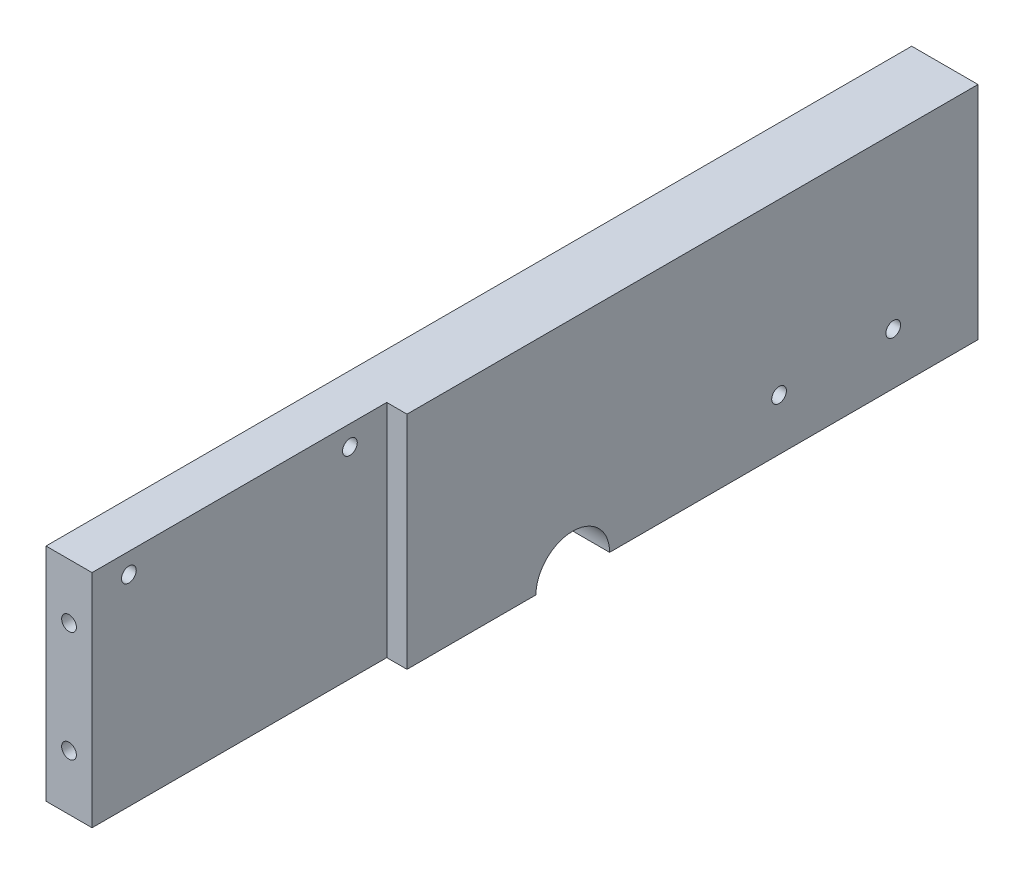
ISO-10303-21;
HEADER;
FILE_DESCRIPTION(('STEP AP214'),'2;1');
FILE_NAME('part.step','',(''),(''),'','','');
FILE_SCHEMA(('AUTOMOTIVE_DESIGN { 1 0 10303 214 1 1 1 1 }'));
ENDSEC;
DATA;
#1=APPLICATION_CONTEXT('core data for automotive mechanical design processes');
#2=APPLICATION_PROTOCOL_DEFINITION('international standard','automotive_design',2000,#1);
#3=PRODUCT_CONTEXT('',#1,'mechanical');
#4=PRODUCT('Part','Part','',(#3));
#5=PRODUCT_RELATED_PRODUCT_CATEGORY('part','',(#4));
#6=PRODUCT_DEFINITION_FORMATION('','',#4);
#7=PRODUCT_DEFINITION_CONTEXT('part definition',#1,'design');
#8=PRODUCT_DEFINITION('design','',#6,#7);
#9=PRODUCT_DEFINITION_SHAPE('','',#8);
#10=(LENGTH_UNIT() NAMED_UNIT(*) SI_UNIT(.MILLI.,.METRE.));
#11=(NAMED_UNIT(*) PLANE_ANGLE_UNIT() SI_UNIT($,.RADIAN.));
#12=(NAMED_UNIT(*) SI_UNIT($,.STERADIAN.) SOLID_ANGLE_UNIT());
#13=UNCERTAINTY_MEASURE_WITH_UNIT(LENGTH_MEASURE(1.E-05),#10,'distance_accuracy_value','');
#14=(GEOMETRIC_REPRESENTATION_CONTEXT(3) GLOBAL_UNCERTAINTY_ASSIGNED_CONTEXT((#13)) GLOBAL_UNIT_ASSIGNED_CONTEXT((#10,
#11,#12)) REPRESENTATION_CONTEXT('',''));
#15=CARTESIAN_POINT('',(0.,0.,0.));
#16=DIRECTION('',(0.,0.,1.));
#17=DIRECTION('',(1.,0.,0.));
#18=AXIS2_PLACEMENT_3D('',#15,#16,#17);
#19=CARTESIAN_POINT('',(12.5,10.604670702918,0.));
#20=DIRECTION('',(0.,1.,0.));
#21=DIRECTION('',(0.,0.,1.));
#22=AXIS2_PLACEMENT_3D('',#19,#20,#21);
#23=PLANE('',#22);
#24=DIRECTION('',(0.,0.,-1.));
#25=VECTOR('',#24,1.);
#26=CARTESIAN_POINT('',(0.,10.604670702918,0.));
#27=LINE('',#26,#25);
#28=CARTESIAN_POINT('',(0.,10.604670702918,64.8267773742609));
#29=VERTEX_POINT('',#28);
#30=CARTESIAN_POINT('',(0.,10.604670702918,-170.173222625739));
#31=VERTEX_POINT('',#30);
#32=EDGE_CURVE('E133',#29,#31,#27,.T.);
#33=ORIENTED_EDGE('',*,*,#32,.F.);
#34=DIRECTION('',(-1.,0.,0.));
#35=VECTOR('',#34,1.);
#36=CARTESIAN_POINT('',(12.5,10.604670702918,64.8267773742609));
#37=LINE('',#36,#35);
#38=CARTESIAN_POINT('',(12.5,10.604670702918,64.8267773742609));
#39=VERTEX_POINT('',#38);
#40=EDGE_CURVE('E11',#39,#29,#37,.T.);
#41=ORIENTED_EDGE('',*,*,#40,.F.);
#42=DIRECTION('',(0.,0.,-1.));
#43=VECTOR('',#42,1.);
#44=CARTESIAN_POINT('',(12.5,10.604670702918,0.));
#45=LINE('',#44,#43);
#46=CARTESIAN_POINT('',(12.5,10.604670702918,-15.1732226257391));
#47=VERTEX_POINT('',#46);
#48=EDGE_CURVE('E81',#39,#47,#45,.T.);
#49=ORIENTED_EDGE('',*,*,#48,.T.);
#50=DIRECTION('',(-1.,0.,0.));
#51=VECTOR('',#50,1.);
#52=CARTESIAN_POINT('',(18.,10.604670702918,-15.1732226257391));
#53=LINE('',#52,#51);
#54=CARTESIAN_POINT('',(18.,10.604670702918,-15.1732226257391));
#55=VERTEX_POINT('',#54);
#56=EDGE_CURVE('E92',#55,#47,#53,.T.);
#57=ORIENTED_EDGE('',*,*,#56,.F.);
#58=DIRECTION('',(0.,0.,-1.));
#59=VECTOR('',#58,1.);
#60=CARTESIAN_POINT('',(18.,10.604670702918,0.));
#61=LINE('',#60,#59);
#62=CARTESIAN_POINT('',(18.,10.604670702918,-170.173222625739));
#63=VERTEX_POINT('',#62);
#64=EDGE_CURVE('E253',#55,#63,#61,.T.);
#65=ORIENTED_EDGE('',*,*,#64,.T.);
#66=DIRECTION('',(-1.,0.,0.));
#67=VECTOR('',#66,1.);
#68=CARTESIAN_POINT('',(18.,10.604670702918,-170.173222625739));
#69=LINE('',#68,#67);
#70=EDGE_CURVE('E99',#63,#31,#69,.T.);
#71=ORIENTED_EDGE('',*,*,#70,.T.);
#72=EDGE_LOOP('',(#33,#41,#49,#57,#65,#71));
#73=FACE_BOUND('',#72,.T.);
#74=ADVANCED_FACE('F34',(#73),#23,.T.);
#75=CARTESIAN_POINT('',(12.5,0.,64.8267773742609));
#76=DIRECTION('',(0.,0.,-1.));
#77=DIRECTION('',(-1.,0.,0.));
#78=AXIS2_PLACEMENT_3D('',#75,#76,#77);
#79=PLANE('',#78);
#80=CARTESIAN_POINT('',(6.25,-34.395329297082,64.8267773742609));
#81=DIRECTION('',(0.,0.,1.));
#82=DIRECTION('',(1.,0.,0.));
#83=AXIS2_PLACEMENT_3D('',#80,#81,#82);
#84=CIRCLE('',#83,2.);
#85=CARTESIAN_POINT('',(8.25,-34.395329297082,64.8267773742609));
#86=VERTEX_POINT('',#85);
#87=EDGE_CURVE('E263',#86,#86,#84,.T.);
#88=ORIENTED_EDGE('',*,*,#87,.F.);
#89=EDGE_LOOP('',(#88));
#90=FACE_BOUND('',#89,.T.);
#91=CARTESIAN_POINT('',(6.25,-4.39532929708202,64.8267773742609));
#92=DIRECTION('',(0.,0.,1.));
#93=DIRECTION('',(1.,0.,0.));
#94=AXIS2_PLACEMENT_3D('',#91,#92,#93);
#95=CIRCLE('',#94,2.);
#96=CARTESIAN_POINT('',(8.25,-4.39532929708202,64.8267773742609));
#97=VERTEX_POINT('',#96);
#98=EDGE_CURVE('E257',#97,#97,#95,.T.);
#99=ORIENTED_EDGE('',*,*,#98,.F.);
#100=EDGE_LOOP('',(#99));
#101=FACE_BOUND('',#100,.T.);
#102=DIRECTION('',(0.,-1.,0.));
#103=VECTOR('',#102,1.);
#104=CARTESIAN_POINT('',(0.,0.,64.8267773742609));
#105=LINE('',#104,#103);
#106=CARTESIAN_POINT('',(0.,-49.395329297082,64.8267773742609));
#107=VERTEX_POINT('',#106);
#108=EDGE_CURVE('E140',#29,#107,#105,.T.);
#109=ORIENTED_EDGE('',*,*,#108,.T.);
#110=DIRECTION('',(-1.,0.,0.));
#111=VECTOR('',#110,1.);
#112=CARTESIAN_POINT('',(12.5,-49.395329297082,64.8267773742609));
#113=LINE('',#112,#111);
#114=CARTESIAN_POINT('',(12.5,-49.395329297082,64.8267773742609));
#115=VERTEX_POINT('',#114);
#116=EDGE_CURVE('E44',#115,#107,#113,.T.);
#117=ORIENTED_EDGE('',*,*,#116,.F.);
#118=DIRECTION('',(0.,-1.,0.));
#119=VECTOR('',#118,1.);
#120=CARTESIAN_POINT('',(12.5,0.,64.8267773742609));
#121=LINE('',#120,#119);
#122=EDGE_CURVE('E94',#39,#115,#121,.T.);
#123=ORIENTED_EDGE('',*,*,#122,.F.);
#124=ORIENTED_EDGE('',*,*,#40,.T.);
#125=EDGE_LOOP('',(#109,#117,#123,#124));
#126=FACE_BOUND('',#125,.T.);
#127=ADVANCED_FACE('F169',(#90,#101,#126),#79,.F.);
#128=CARTESIAN_POINT('',(12.5,5.15467070291798,54.8267773742609));
#129=DIRECTION('',(-1.,0.,0.));
#130=DIRECTION('',(0.,0.,1.));
#131=AXIS2_PLACEMENT_3D('',#128,#129,#130);
#132=CYLINDRICAL_SURFACE('',#131,2.);
#133=CARTESIAN_POINT('',(12.5,5.15467070291798,54.8267773742609));
#134=DIRECTION('',(1.,0.,0.));
#135=DIRECTION('',(0.,0.,-1.));
#136=AXIS2_PLACEMENT_3D('',#133,#134,#135);
#137=CIRCLE('',#136,2.);
#138=CARTESIAN_POINT('',(12.5,5.15467070291798,52.8267773742609));
#139=VERTEX_POINT('',#138);
#140=EDGE_CURVE('E85',#139,#139,#137,.T.);
#141=ORIENTED_EDGE('',*,*,#140,.T.);
#142=EDGE_LOOP('',(#141));
#143=FACE_BOUND('',#142,.T.);
#144=CARTESIAN_POINT('',(0.,5.15467070291798,54.8267773742609));
#145=DIRECTION('',(1.,0.,0.));
#146=DIRECTION('',(0.,0.,-1.));
#147=AXIS2_PLACEMENT_3D('',#144,#145,#146);
#148=CIRCLE('',#147,2.);
#149=CARTESIAN_POINT('',(0.,5.15467070291798,52.8267773742609));
#150=VERTEX_POINT('',#149);
#151=EDGE_CURVE('E128',#150,#150,#148,.T.);
#152=ORIENTED_EDGE('',*,*,#151,.F.);
#153=EDGE_LOOP('',(#152));
#154=FACE_BOUND('',#153,.T.);
#155=ADVANCED_FACE('F174',(#143,#154),#132,.F.);
#156=CARTESIAN_POINT('',(12.5,5.15467070291799,-5.17322262573909));
#157=DIRECTION('',(-1.,0.,0.));
#158=DIRECTION('',(0.,0.,1.));
#159=AXIS2_PLACEMENT_3D('',#156,#157,#158);
#160=CYLINDRICAL_SURFACE('',#159,2.);
#161=CARTESIAN_POINT('',(12.5,5.15467070291799,-5.17322262573909));
#162=DIRECTION('',(1.,0.,0.));
#163=DIRECTION('',(0.,0.,-1.));
#164=AXIS2_PLACEMENT_3D('',#161,#162,#163);
#165=CIRCLE('',#164,2.);
#166=CARTESIAN_POINT('',(12.5,5.15467070291799,-7.17322262573909));
#167=VERTEX_POINT('',#166);
#168=EDGE_CURVE('E111',#167,#167,#165,.T.);
#169=ORIENTED_EDGE('',*,*,#168,.T.);
#170=EDGE_LOOP('',(#169));
#171=FACE_BOUND('',#170,.T.);
#172=CARTESIAN_POINT('',(0.,5.15467070291799,-5.17322262573909));
#173=DIRECTION('',(1.,0.,0.));
#174=DIRECTION('',(0.,0.,-1.));
#175=AXIS2_PLACEMENT_3D('',#172,#173,#174);
#176=CIRCLE('',#175,2.);
#177=CARTESIAN_POINT('',(0.,5.15467070291799,-7.17322262573909));
#178=VERTEX_POINT('',#177);
#179=EDGE_CURVE('E120',#178,#178,#176,.T.);
#180=ORIENTED_EDGE('',*,*,#179,.F.);
#181=EDGE_LOOP('',(#180));
#182=FACE_BOUND('',#181,.T.);
#183=ADVANCED_FACE('F36',(#171,#182),#160,.F.);
#184=CARTESIAN_POINT('',(12.5,-49.395329297082,0.));
#185=DIRECTION('',(0.,1.,0.));
#186=DIRECTION('',(0.,0.,1.));
#187=AXIS2_PLACEMENT_3D('',#184,#185,#186);
#188=PLANE('',#187);
#189=DIRECTION('',(0.,0.,-1.));
#190=VECTOR('',#189,1.);
#191=CARTESIAN_POINT('',(0.,-49.395329297082,0.));
#192=LINE('',#191,#190);
#193=CARTESIAN_POINT('',(0.,-49.395329297082,-50.1732226257391));
#194=VERTEX_POINT('',#193);
#195=EDGE_CURVE('E142',#107,#194,#192,.T.);
#196=ORIENTED_EDGE('',*,*,#195,.T.);
#197=DIRECTION('',(-1.,0.,0.));
#198=VECTOR('',#197,1.);
#199=CARTESIAN_POINT('',(18.,-49.395329297082,-50.1732226257391));
#200=LINE('',#199,#198);
#201=CARTESIAN_POINT('',(18.,-49.395329297082,-50.1732226257391));
#202=VERTEX_POINT('',#201);
#203=EDGE_CURVE('E105',#202,#194,#200,.T.);
#204=ORIENTED_EDGE('',*,*,#203,.F.);
#205=DIRECTION('',(0.,0.,-1.));
#206=VECTOR('',#205,1.);
#207=CARTESIAN_POINT('',(18.,-49.395329297082,0.));
#208=LINE('',#207,#206);
#209=CARTESIAN_POINT('',(18.,-49.395329297082,-15.1732226257391));
#210=VERTEX_POINT('',#209);
#211=EDGE_CURVE('E216',#210,#202,#208,.T.);
#212=ORIENTED_EDGE('',*,*,#211,.F.);
#213=DIRECTION('',(-1.,0.,0.));
#214=VECTOR('',#213,1.);
#215=CARTESIAN_POINT('',(18.,-49.395329297082,-15.1732226257391));
#216=LINE('',#215,#214);
#217=CARTESIAN_POINT('',(12.5,-49.395329297082,-15.1732226257391));
#218=VERTEX_POINT('',#217);
#219=EDGE_CURVE('E100',#210,#218,#216,.T.);
#220=ORIENTED_EDGE('',*,*,#219,.T.);
#221=DIRECTION('',(0.,0.,-1.));
#222=VECTOR('',#221,1.);
#223=CARTESIAN_POINT('',(12.5,-49.395329297082,0.));
#224=LINE('',#223,#222);
#225=EDGE_CURVE('E53',#115,#218,#224,.T.);
#226=ORIENTED_EDGE('',*,*,#225,.F.);
#227=ORIENTED_EDGE('',*,*,#116,.T.);
#228=EDGE_LOOP('',(#196,#204,#212,#220,#226,#227));
#229=FACE_BOUND('',#228,.T.);
#230=ADVANCED_FACE('F159',(#229),#188,.F.);
#231=CARTESIAN_POINT('',(12.5,0.,0.));
#232=DIRECTION('',(1.,0.,0.));
#233=DIRECTION('',(0.,0.,-1.));
#234=AXIS2_PLACEMENT_3D('',#231,#232,#233);
#235=PLANE('',#234);
#236=ORIENTED_EDGE('',*,*,#168,.F.);
#237=EDGE_LOOP('',(#236));
#238=FACE_BOUND('',#237,.T.);
#239=ORIENTED_EDGE('',*,*,#140,.F.);
#240=EDGE_LOOP('',(#239));
#241=FACE_BOUND('',#240,.T.);
#242=DIRECTION('',(0.,-1.,0.));
#243=VECTOR('',#242,1.);
#244=CARTESIAN_POINT('',(12.5,0.,-15.1732226257391));
#245=LINE('',#244,#243);
#246=EDGE_CURVE('E78',#47,#218,#245,.T.);
#247=ORIENTED_EDGE('',*,*,#246,.F.);
#248=ORIENTED_EDGE('',*,*,#48,.F.);
#249=ORIENTED_EDGE('',*,*,#122,.T.);
#250=ORIENTED_EDGE('',*,*,#225,.T.);
#251=EDGE_LOOP('',(#247,#248,#249,#250));
#252=FACE_BOUND('',#251,.T.);
#253=ADVANCED_FACE('F80',(#238,#241,#252),#235,.T.);
#254=CARTESIAN_POINT('',(0.,0.,0.));
#255=DIRECTION('',(1.,0.,0.));
#256=DIRECTION('',(0.,0.,-1.));
#257=AXIS2_PLACEMENT_3D('',#254,#255,#256);
#258=PLANE('',#257);
#259=ORIENTED_EDGE('',*,*,#179,.T.);
#260=EDGE_LOOP('',(#259));
#261=FACE_BOUND('',#260,.T.);
#262=ORIENTED_EDGE('',*,*,#151,.T.);
#263=EDGE_LOOP('',(#262));
#264=FACE_BOUND('',#263,.T.);
#265=ORIENTED_EDGE('',*,*,#32,.T.);
#266=DIRECTION('',(0.,-1.,0.));
#267=VECTOR('',#266,1.);
#268=CARTESIAN_POINT('',(0.,0.,-170.173222625739));
#269=LINE('',#268,#267);
#270=CARTESIAN_POINT('',(0.,-49.395329297082,-170.173222625739));
#271=VERTEX_POINT('',#270);
#272=EDGE_CURVE('E201',#31,#271,#269,.T.);
#273=ORIENTED_EDGE('',*,*,#272,.T.);
#274=DIRECTION('',(0.,0.,-1.));
#275=VECTOR('',#274,1.);
#276=CARTESIAN_POINT('',(0.,-49.395329297082,0.));
#277=LINE('',#276,#275);
#278=CARTESIAN_POINT('',(0.,-49.395329297082,-70.1732226257391));
#279=VERTEX_POINT('',#278);
#280=EDGE_CURVE('E222',#279,#271,#277,.T.);
#281=ORIENTED_EDGE('',*,*,#280,.F.);
#282=CARTESIAN_POINT('',(0.,-49.395329297082,-60.1732226257391));
#283=DIRECTION('',(1.,0.,0.));
#284=DIRECTION('',(0.,0.,-1.));
#285=AXIS2_PLACEMENT_3D('',#282,#283,#284);
#286=CIRCLE('',#285,10.);
#287=EDGE_CURVE('E220',#279,#194,#286,.T.);
#288=ORIENTED_EDGE('',*,*,#287,.T.);
#289=ORIENTED_EDGE('',*,*,#195,.F.);
#290=ORIENTED_EDGE('',*,*,#108,.F.);
#291=EDGE_LOOP('',(#265,#273,#281,#288,#289,#290));
#292=FACE_BOUND('',#291,.T.);
#293=CARTESIAN_POINT('',(0.,-35.395329297082,-116.173222625739));
#294=DIRECTION('',(1.,0.,0.));
#295=DIRECTION('',(0.,0.,-1.));
#296=AXIS2_PLACEMENT_3D('',#293,#294,#295);
#297=CIRCLE('',#296,2.);
#298=CARTESIAN_POINT('',(0.,-35.395329297082,-118.173222625739));
#299=VERTEX_POINT('',#298);
#300=EDGE_CURVE('E191',#299,#299,#297,.T.);
#301=ORIENTED_EDGE('',*,*,#300,.T.);
#302=EDGE_LOOP('',(#301));
#303=FACE_BOUND('',#302,.T.);
#304=CARTESIAN_POINT('',(0.,-35.395329297082,-147.173222625739));
#305=DIRECTION('',(1.,0.,0.));
#306=DIRECTION('',(0.,0.,-1.));
#307=AXIS2_PLACEMENT_3D('',#304,#305,#306);
#308=CIRCLE('',#307,2.);
#309=CARTESIAN_POINT('',(0.,-35.395329297082,-149.173222625739));
#310=VERTEX_POINT('',#309);
#311=EDGE_CURVE('E194',#310,#310,#308,.T.);
#312=ORIENTED_EDGE('',*,*,#311,.T.);
#313=EDGE_LOOP('',(#312));
#314=FACE_BOUND('',#313,.T.);
#315=ADVANCED_FACE('F158',(#261,#264,#292,#303,#314),#258,.F.);
#316=CARTESIAN_POINT('',(18.,0.,-15.1732226257391));
#317=DIRECTION('',(0.,0.,-1.));
#318=DIRECTION('',(0.,1.,0.));
#319=AXIS2_PLACEMENT_3D('',#316,#317,#318);
#320=PLANE('',#319);
#321=ORIENTED_EDGE('',*,*,#56,.T.);
#322=ORIENTED_EDGE('',*,*,#246,.T.);
#323=ORIENTED_EDGE('',*,*,#219,.F.);
#324=DIRECTION('',(0.,-1.,0.));
#325=VECTOR('',#324,1.);
#326=CARTESIAN_POINT('',(18.,0.,-15.1732226257391));
#327=LINE('',#326,#325);
#328=EDGE_CURVE('E97',#55,#210,#327,.T.);
#329=ORIENTED_EDGE('',*,*,#328,.F.);
#330=EDGE_LOOP('',(#321,#322,#323,#329));
#331=FACE_BOUND('',#330,.T.);
#332=ADVANCED_FACE('F95',(#331),#320,.F.);
#333=CARTESIAN_POINT('',(18.,-49.395329297082,-60.1732226257391));
#334=DIRECTION('',(-1.,0.,0.));
#335=DIRECTION('',(0.,0.,1.));
#336=AXIS2_PLACEMENT_3D('',#333,#334,#335);
#337=CYLINDRICAL_SURFACE('',#336,10.);
#338=ORIENTED_EDGE('',*,*,#287,.F.);
#339=DIRECTION('',(-1.,0.,0.));
#340=VECTOR('',#339,1.);
#341=CARTESIAN_POINT('',(18.,-49.395329297082,-70.1732226257391));
#342=LINE('',#341,#340);
#343=CARTESIAN_POINT('',(18.,-49.395329297082,-70.1732226257391));
#344=VERTEX_POINT('',#343);
#345=EDGE_CURVE('E118',#344,#279,#342,.T.);
#346=ORIENTED_EDGE('',*,*,#345,.F.);
#347=CARTESIAN_POINT('',(18.,-49.395329297082,-60.1732226257391));
#348=DIRECTION('',(1.,0.,0.));
#349=DIRECTION('',(0.,0.,-1.));
#350=AXIS2_PLACEMENT_3D('',#347,#348,#349);
#351=CIRCLE('',#350,10.);
#352=EDGE_CURVE('E196',#344,#202,#351,.T.);
#353=ORIENTED_EDGE('',*,*,#352,.T.);
#354=ORIENTED_EDGE('',*,*,#203,.T.);
#355=EDGE_LOOP('',(#338,#346,#353,#354));
#356=FACE_BOUND('',#355,.T.);
#357=ADVANCED_FACE('F243',(#356),#337,.F.);
#358=CARTESIAN_POINT('',(18.,-49.395329297082,0.));
#359=DIRECTION('',(0.,1.,0.));
#360=DIRECTION('',(0.,0.,1.));
#361=AXIS2_PLACEMENT_3D('',#358,#359,#360);
#362=PLANE('',#361);
#363=ORIENTED_EDGE('',*,*,#280,.T.);
#364=DIRECTION('',(-1.,0.,0.));
#365=VECTOR('',#364,1.);
#366=CARTESIAN_POINT('',(18.,-49.395329297082,-170.173222625739));
#367=LINE('',#366,#365);
#368=CARTESIAN_POINT('',(18.,-49.395329297082,-170.173222625739));
#369=VERTEX_POINT('',#368);
#370=EDGE_CURVE('E103',#369,#271,#367,.T.);
#371=ORIENTED_EDGE('',*,*,#370,.F.);
#372=EDGE_CURVE('E199',#344,#369,#208,.T.);
#373=ORIENTED_EDGE('',*,*,#372,.F.);
#374=ORIENTED_EDGE('',*,*,#345,.T.);
#375=EDGE_LOOP('',(#363,#371,#373,#374));
#376=FACE_BOUND('',#375,.T.);
#377=ADVANCED_FACE('F245',(#376),#362,.F.);
#378=CARTESIAN_POINT('',(18.,0.,-170.173222625739));
#379=DIRECTION('',(0.,0.,-1.));
#380=DIRECTION('',(-1.,0.,0.));
#381=AXIS2_PLACEMENT_3D('',#378,#379,#380);
#382=PLANE('',#381);
#383=ORIENTED_EDGE('',*,*,#272,.F.);
#384=ORIENTED_EDGE('',*,*,#70,.F.);
#385=DIRECTION('',(0.,-1.,0.));
#386=VECTOR('',#385,1.);
#387=CARTESIAN_POINT('',(18.,0.,-170.173222625739));
#388=LINE('',#387,#386);
#389=EDGE_CURVE('E247',#63,#369,#388,.T.);
#390=ORIENTED_EDGE('',*,*,#389,.T.);
#391=ORIENTED_EDGE('',*,*,#370,.T.);
#392=EDGE_LOOP('',(#383,#384,#390,#391));
#393=FACE_BOUND('',#392,.T.);
#394=ADVANCED_FACE('F229',(#393),#382,.T.);
#395=CARTESIAN_POINT('',(18.,-35.395329297082,-116.173222625739));
#396=DIRECTION('',(-1.,0.,0.));
#397=DIRECTION('',(0.,0.,1.));
#398=AXIS2_PLACEMENT_3D('',#395,#396,#397);
#399=CYLINDRICAL_SURFACE('',#398,2.);
#400=CARTESIAN_POINT('',(18.,-35.395329297082,-116.173222625739));
#401=DIRECTION('',(1.,0.,0.));
#402=DIRECTION('',(0.,0.,-1.));
#403=AXIS2_PLACEMENT_3D('',#400,#401,#402);
#404=CIRCLE('',#403,2.);
#405=CARTESIAN_POINT('',(18.,-35.395329297082,-118.173222625739));
#406=VERTEX_POINT('',#405);
#407=EDGE_CURVE('E211',#406,#406,#404,.T.);
#408=ORIENTED_EDGE('',*,*,#407,.T.);
#409=EDGE_LOOP('',(#408));
#410=FACE_BOUND('',#409,.T.);
#411=ORIENTED_EDGE('',*,*,#300,.F.);
#412=EDGE_LOOP('',(#411));
#413=FACE_BOUND('',#412,.T.);
#414=ADVANCED_FACE('F296',(#410,#413),#399,.F.);
#415=CARTESIAN_POINT('',(18.,-35.395329297082,-147.173222625739));
#416=DIRECTION('',(-1.,0.,0.));
#417=DIRECTION('',(0.,0.,1.));
#418=AXIS2_PLACEMENT_3D('',#415,#416,#417);
#419=CYLINDRICAL_SURFACE('',#418,2.);
#420=CARTESIAN_POINT('',(18.,-35.395329297082,-147.173222625739));
#421=DIRECTION('',(1.,0.,0.));
#422=DIRECTION('',(0.,0.,-1.));
#423=AXIS2_PLACEMENT_3D('',#420,#421,#422);
#424=CIRCLE('',#423,2.);
#425=CARTESIAN_POINT('',(18.,-35.395329297082,-149.173222625739));
#426=VERTEX_POINT('',#425);
#427=EDGE_CURVE('E205',#426,#426,#424,.T.);
#428=ORIENTED_EDGE('',*,*,#427,.T.);
#429=EDGE_LOOP('',(#428));
#430=FACE_BOUND('',#429,.T.);
#431=ORIENTED_EDGE('',*,*,#311,.F.);
#432=EDGE_LOOP('',(#431));
#433=FACE_BOUND('',#432,.T.);
#434=ADVANCED_FACE('F290',(#430,#433),#419,.F.);
#435=CARTESIAN_POINT('',(18.,0.,0.));
#436=DIRECTION('',(1.,0.,0.));
#437=DIRECTION('',(0.,0.,-1.));
#438=AXIS2_PLACEMENT_3D('',#435,#436,#437);
#439=PLANE('',#438);
#440=ORIENTED_EDGE('',*,*,#352,.F.);
#441=ORIENTED_EDGE('',*,*,#372,.T.);
#442=ORIENTED_EDGE('',*,*,#389,.F.);
#443=ORIENTED_EDGE('',*,*,#64,.F.);
#444=ORIENTED_EDGE('',*,*,#328,.T.);
#445=ORIENTED_EDGE('',*,*,#211,.T.);
#446=EDGE_LOOP('',(#440,#441,#442,#443,#444,#445));
#447=FACE_BOUND('',#446,.T.);
#448=ORIENTED_EDGE('',*,*,#407,.F.);
#449=EDGE_LOOP('',(#448));
#450=FACE_BOUND('',#449,.T.);
#451=ORIENTED_EDGE('',*,*,#427,.F.);
#452=EDGE_LOOP('',(#451));
#453=FACE_BOUND('',#452,.T.);
#454=ADVANCED_FACE('F249',(#447,#450,#453),#439,.T.);
#455=CARTESIAN_POINT('',(6.25,-4.39532929708202,54.8267773742609));
#456=DIRECTION('',(0.,0.,1.));
#457=DIRECTION('',(1.,0.,0.));
#458=AXIS2_PLACEMENT_3D('',#455,#456,#457);
#459=CYLINDRICAL_SURFACE('',#458,2.);
#460=CARTESIAN_POINT('',(6.25,-4.39532929708202,54.8267773742609));
#461=DIRECTION('',(0.,0.,1.));
#462=DIRECTION('',(1.,0.,0.));
#463=AXIS2_PLACEMENT_3D('',#460,#461,#462);
#464=CIRCLE('',#463,2.);
#465=CARTESIAN_POINT('',(8.25,-4.39532929708202,54.8267773742609));
#466=VERTEX_POINT('',#465);
#467=EDGE_CURVE('E223',#466,#466,#464,.T.);
#468=ORIENTED_EDGE('',*,*,#467,.F.);
#469=EDGE_LOOP('',(#468));
#470=FACE_BOUND('',#469,.T.);
#471=ORIENTED_EDGE('',*,*,#98,.T.);
#472=EDGE_LOOP('',(#471));
#473=FACE_BOUND('',#472,.T.);
#474=ADVANCED_FACE('F280',(#470,#473),#459,.F.);
#475=CARTESIAN_POINT('',(6.25,-4.39532929708202,54.8267773742609));
#476=DIRECTION('',(0.,0.,1.));
#477=DIRECTION('',(1.,0.,0.));
#478=AXIS2_PLACEMENT_3D('',#475,#476,#477);
#479=PLANE('',#478);
#480=ORIENTED_EDGE('',*,*,#467,.T.);
#481=EDGE_LOOP('',(#480));
#482=FACE_BOUND('',#481,.T.);
#483=ADVANCED_FACE('F274',(#482),#479,.T.);
#484=CARTESIAN_POINT('',(6.25,-34.395329297082,54.8267773742609));
#485=DIRECTION('',(0.,0.,1.));
#486=DIRECTION('',(1.,0.,0.));
#487=AXIS2_PLACEMENT_3D('',#484,#485,#486);
#488=CYLINDRICAL_SURFACE('',#487,2.);
#489=CARTESIAN_POINT('',(6.25,-34.395329297082,54.8267773742609));
#490=DIRECTION('',(0.,0.,1.));
#491=DIRECTION('',(1.,0.,0.));
#492=AXIS2_PLACEMENT_3D('',#489,#490,#491);
#493=CIRCLE('',#492,2.);
#494=CARTESIAN_POINT('',(8.25,-34.395329297082,54.8267773742609));
#495=VERTEX_POINT('',#494);
#496=EDGE_CURVE('E260',#495,#495,#493,.T.);
#497=ORIENTED_EDGE('',*,*,#496,.F.);
#498=EDGE_LOOP('',(#497));
#499=FACE_BOUND('',#498,.T.);
#500=ORIENTED_EDGE('',*,*,#87,.T.);
#501=EDGE_LOOP('',(#500));
#502=FACE_BOUND('',#501,.T.);
#503=ADVANCED_FACE('F271',(#499,#502),#488,.F.);
#504=CARTESIAN_POINT('',(6.25,-34.395329297082,54.8267773742609));
#505=DIRECTION('',(0.,0.,1.));
#506=DIRECTION('',(1.,0.,0.));
#507=AXIS2_PLACEMENT_3D('',#504,#505,#506);
#508=PLANE('',#507);
#509=ORIENTED_EDGE('',*,*,#496,.T.);
#510=EDGE_LOOP('',(#509));
#511=FACE_BOUND('',#510,.T.);
#512=ADVANCED_FACE('F269',(#511),#508,.T.);
#513=CLOSED_SHELL('',(#74,#127,#155,#183,#230,#253,#315,#332,#357,#377,#394,#414,#434,#454,#474,
#483,#503,#512));
#514=MANIFOLD_SOLID_BREP('B2',#513);
#515=ADVANCED_BREP_SHAPE_REPRESENTATION('',(#18,#514),#14);
#516=SHAPE_DEFINITION_REPRESENTATION(#9,#515);
ENDSEC;
END-ISO-10303-21;
